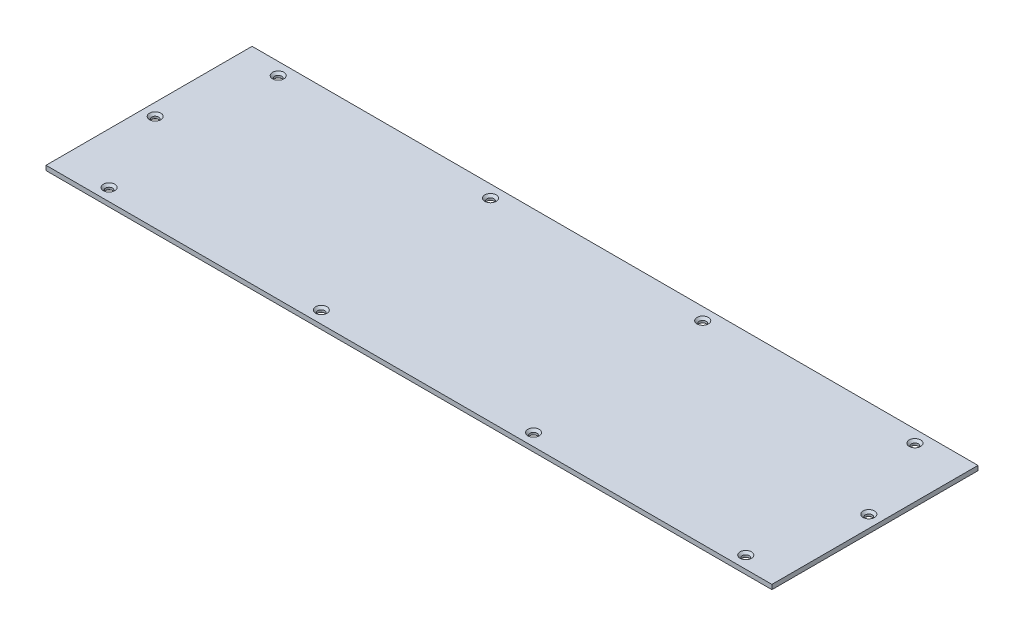
ISO-10303-21;
HEADER;
FILE_DESCRIPTION(('STEP AP214'),'2;1');
FILE_NAME('part.step','',(''),(''),'','','');
FILE_SCHEMA(('AUTOMOTIVE_DESIGN { 1 0 10303 214 1 1 1 1 }'));
ENDSEC;
DATA;
#1=APPLICATION_CONTEXT('core data for automotive mechanical design processes');
#2=APPLICATION_PROTOCOL_DEFINITION('international standard','automotive_design',2000,#1);
#3=PRODUCT_CONTEXT('',#1,'mechanical');
#4=PRODUCT('Part','Part','',(#3));
#5=PRODUCT_RELATED_PRODUCT_CATEGORY('part','',(#4));
#6=PRODUCT_DEFINITION_FORMATION('','',#4);
#7=PRODUCT_DEFINITION_CONTEXT('part definition',#1,'design');
#8=PRODUCT_DEFINITION('design','',#6,#7);
#9=PRODUCT_DEFINITION_SHAPE('','',#8);
#10=(LENGTH_UNIT() NAMED_UNIT(*) SI_UNIT(.MILLI.,.METRE.));
#11=(NAMED_UNIT(*) PLANE_ANGLE_UNIT() SI_UNIT($,.RADIAN.));
#12=(NAMED_UNIT(*) SI_UNIT($,.STERADIAN.) SOLID_ANGLE_UNIT());
#13=UNCERTAINTY_MEASURE_WITH_UNIT(LENGTH_MEASURE(1.E-05),#10,'distance_accuracy_value','');
#14=(GEOMETRIC_REPRESENTATION_CONTEXT(3) GLOBAL_UNCERTAINTY_ASSIGNED_CONTEXT((#13)) GLOBAL_UNIT_ASSIGNED_CONTEXT((#10,
#11,#12)) REPRESENTATION_CONTEXT('',''));
#15=CARTESIAN_POINT('',(0.,0.,0.));
#16=DIRECTION('',(0.,0.,1.));
#17=DIRECTION('',(1.,0.,0.));
#18=AXIS2_PLACEMENT_3D('',#15,#16,#17);
#19=CARTESIAN_POINT('',(0.,3.,0.));
#20=DIRECTION('',(1.,0.,0.));
#21=DIRECTION('',(0.,0.,-1.));
#22=AXIS2_PLACEMENT_3D('',#19,#20,#21);
#23=PLANE('',#22);
#24=DIRECTION('',(0.,0.,1.));
#25=VECTOR('',#24,1.);
#26=CARTESIAN_POINT('',(0.,0.,0.));
#27=LINE('',#26,#25);
#28=CARTESIAN_POINT('',(0.,0.,-134.));
#29=VERTEX_POINT('',#28);
#30=CARTESIAN_POINT('',(0.,0.,0.));
#31=VERTEX_POINT('',#30);
#32=EDGE_CURVE('E94',#29,#31,#27,.T.);
#33=ORIENTED_EDGE('',*,*,#32,.T.);
#34=DIRECTION('',(0.,-1.,0.));
#35=VECTOR('',#34,1.);
#36=CARTESIAN_POINT('',(0.,3.,0.));
#37=LINE('',#36,#35);
#38=CARTESIAN_POINT('',(0.,3.,0.));
#39=VERTEX_POINT('',#38);
#40=EDGE_CURVE('E11',#39,#31,#37,.T.);
#41=ORIENTED_EDGE('',*,*,#40,.F.);
#42=DIRECTION('',(0.,0.,1.));
#43=VECTOR('',#42,1.);
#44=CARTESIAN_POINT('',(0.,3.,0.));
#45=LINE('',#44,#43);
#46=CARTESIAN_POINT('',(0.,3.,-134.));
#47=VERTEX_POINT('',#46);
#48=EDGE_CURVE('E82',#47,#39,#45,.T.);
#49=ORIENTED_EDGE('',*,*,#48,.F.);
#50=DIRECTION('',(0.,-1.,0.));
#51=VECTOR('',#50,1.);
#52=CARTESIAN_POINT('',(0.,3.,-134.));
#53=LINE('',#52,#51);
#54=EDGE_CURVE('E90',#47,#29,#53,.T.);
#55=ORIENTED_EDGE('',*,*,#54,.T.);
#56=EDGE_LOOP('',(#33,#41,#49,#55));
#57=FACE_BOUND('',#56,.T.);
#58=ADVANCED_FACE('F31',(#57),#23,.F.);
#59=CARTESIAN_POINT('',(0.,3.,0.));
#60=DIRECTION('',(0.,0.,-1.));
#61=DIRECTION('',(-1.,0.,0.));
#62=AXIS2_PLACEMENT_3D('',#59,#60,#61);
#63=PLANE('',#62);
#64=DIRECTION('',(1.,0.,0.));
#65=VECTOR('',#64,1.);
#66=CARTESIAN_POINT('',(0.,0.,0.));
#67=LINE('',#66,#65);
#68=CARTESIAN_POINT('',(472.,0.,0.));
#69=VERTEX_POINT('',#68);
#70=EDGE_CURVE('E86',#31,#69,#67,.T.);
#71=ORIENTED_EDGE('',*,*,#70,.T.);
#72=DIRECTION('',(0.,-1.,0.));
#73=VECTOR('',#72,1.);
#74=CARTESIAN_POINT('',(472.,3.,0.));
#75=LINE('',#74,#73);
#76=CARTESIAN_POINT('',(472.,3.,0.));
#77=VERTEX_POINT('',#76);
#78=EDGE_CURVE('E39',#77,#69,#75,.T.);
#79=ORIENTED_EDGE('',*,*,#78,.F.);
#80=DIRECTION('',(1.,0.,0.));
#81=VECTOR('',#80,1.);
#82=CARTESIAN_POINT('',(0.,3.,0.));
#83=LINE('',#82,#81);
#84=EDGE_CURVE('E77',#39,#77,#83,.T.);
#85=ORIENTED_EDGE('',*,*,#84,.F.);
#86=ORIENTED_EDGE('',*,*,#40,.T.);
#87=EDGE_LOOP('',(#71,#79,#85,#86));
#88=FACE_BOUND('',#87,.T.);
#89=ADVANCED_FACE('F85',(#88),#63,.F.);
#90=CARTESIAN_POINT('',(472.,3.,0.));
#91=DIRECTION('',(-1.,0.,0.));
#92=DIRECTION('',(0.,0.,1.));
#93=AXIS2_PLACEMENT_3D('',#90,#91,#92);
#94=PLANE('',#93);
#95=DIRECTION('',(0.,0.,-1.));
#96=VECTOR('',#95,1.);
#97=CARTESIAN_POINT('',(472.,0.,0.));
#98=LINE('',#97,#96);
#99=CARTESIAN_POINT('',(472.,0.,-134.));
#100=VERTEX_POINT('',#99);
#101=EDGE_CURVE('E64',#69,#100,#98,.T.);
#102=ORIENTED_EDGE('',*,*,#101,.T.);
#103=DIRECTION('',(0.,-1.,0.));
#104=VECTOR('',#103,1.);
#105=CARTESIAN_POINT('',(472.,3.,-134.));
#106=LINE('',#105,#104);
#107=CARTESIAN_POINT('',(472.,3.,-134.));
#108=VERTEX_POINT('',#107);
#109=EDGE_CURVE('E87',#108,#100,#106,.T.);
#110=ORIENTED_EDGE('',*,*,#109,.F.);
#111=DIRECTION('',(0.,0.,-1.));
#112=VECTOR('',#111,1.);
#113=CARTESIAN_POINT('',(472.,3.,0.));
#114=LINE('',#113,#112);
#115=EDGE_CURVE('E80',#77,#108,#114,.T.);
#116=ORIENTED_EDGE('',*,*,#115,.F.);
#117=ORIENTED_EDGE('',*,*,#78,.T.);
#118=EDGE_LOOP('',(#102,#110,#116,#117));
#119=FACE_BOUND('',#118,.T.);
#120=ADVANCED_FACE('F88',(#119),#94,.F.);
#121=CARTESIAN_POINT('',(0.,3.,-134.));
#122=DIRECTION('',(0.,0.,1.));
#123=DIRECTION('',(1.,0.,0.));
#124=AXIS2_PLACEMENT_3D('',#121,#122,#123);
#125=PLANE('',#124);
#126=DIRECTION('',(-1.,0.,0.));
#127=VECTOR('',#126,1.);
#128=CARTESIAN_POINT('',(0.,0.,-134.));
#129=LINE('',#128,#127);
#130=EDGE_CURVE('E70',#100,#29,#129,.T.);
#131=ORIENTED_EDGE('',*,*,#130,.T.);
#132=ORIENTED_EDGE('',*,*,#54,.F.);
#133=DIRECTION('',(-1.,0.,0.));
#134=VECTOR('',#133,1.);
#135=CARTESIAN_POINT('',(0.,3.,-134.));
#136=LINE('',#135,#134);
#137=EDGE_CURVE('E47',#108,#47,#136,.T.);
#138=ORIENTED_EDGE('',*,*,#137,.F.);
#139=ORIENTED_EDGE('',*,*,#109,.T.);
#140=EDGE_LOOP('',(#131,#132,#138,#139));
#141=FACE_BOUND('',#140,.T.);
#142=ADVANCED_FACE('F102',(#141),#125,.F.);
#143=CARTESIAN_POINT('',(0.,3.,-134.));
#144=DIRECTION('',(0.,-1.,0.));
#145=DIRECTION('',(0.,0.,-1.));
#146=AXIS2_PLACEMENT_3D('',#143,#144,#145);
#147=PLANE('',#146);
#148=CARTESIAN_POINT('',(25.0000000000003,3.,-126.));
#149=DIRECTION('',(0.,1.,0.));
#150=DIRECTION('',(0.,0.,1.));
#151=AXIS2_PLACEMENT_3D('',#148,#149,#150);
#152=CIRCLE('',#151,3.7);
#153=CARTESIAN_POINT('',(25.0000000000003,3.,-122.3));
#154=VERTEX_POINT('',#153);
#155=EDGE_CURVE('E221',#154,#154,#152,.T.);
#156=ORIENTED_EDGE('',*,*,#155,.F.);
#157=EDGE_LOOP('',(#156));
#158=FACE_BOUND('',#157,.T.);
#159=CARTESIAN_POINT('',(163.,3.,-126.));
#160=DIRECTION('',(0.,1.,0.));
#161=DIRECTION('',(0.,0.,1.));
#162=AXIS2_PLACEMENT_3D('',#159,#160,#161);
#163=CIRCLE('',#162,3.70000000000001);
#164=CARTESIAN_POINT('',(163.,3.,-122.3));
#165=VERTEX_POINT('',#164);
#166=EDGE_CURVE('E209',#165,#165,#163,.T.);
#167=ORIENTED_EDGE('',*,*,#166,.F.);
#168=EDGE_LOOP('',(#167));
#169=FACE_BOUND('',#168,.T.);
#170=CARTESIAN_POINT('',(301.,3.,-126.));
#171=DIRECTION('',(0.,1.,0.));
#172=DIRECTION('',(0.,0.,1.));
#173=AXIS2_PLACEMENT_3D('',#170,#171,#172);
#174=CIRCLE('',#173,3.69999999999998);
#175=CARTESIAN_POINT('',(301.,3.,-122.3));
#176=VERTEX_POINT('',#175);
#177=EDGE_CURVE('E197',#176,#176,#174,.T.);
#178=ORIENTED_EDGE('',*,*,#177,.F.);
#179=EDGE_LOOP('',(#178));
#180=FACE_BOUND('',#179,.T.);
#181=CARTESIAN_POINT('',(439.,3.,-126.));
#182=DIRECTION('',(0.,1.,0.));
#183=DIRECTION('',(0.,0.,1.));
#184=AXIS2_PLACEMENT_3D('',#181,#182,#183);
#185=CIRCLE('',#184,3.69999999999998);
#186=CARTESIAN_POINT('',(439.,3.,-122.3));
#187=VERTEX_POINT('',#186);
#188=EDGE_CURVE('E185',#187,#187,#185,.T.);
#189=ORIENTED_EDGE('',*,*,#188,.F.);
#190=EDGE_LOOP('',(#189));
#191=FACE_BOUND('',#190,.T.);
#192=CARTESIAN_POINT('',(464.,3.,-71.));
#193=DIRECTION('',(0.,1.,0.));
#194=DIRECTION('',(0.,0.,1.));
#195=AXIS2_PLACEMENT_3D('',#192,#193,#194);
#196=CIRCLE('',#195,3.69999999999998);
#197=CARTESIAN_POINT('',(464.,3.,-67.3));
#198=VERTEX_POINT('',#197);
#199=EDGE_CURVE('E173',#198,#198,#196,.T.);
#200=ORIENTED_EDGE('',*,*,#199,.F.);
#201=EDGE_LOOP('',(#200));
#202=FACE_BOUND('',#201,.T.);
#203=CARTESIAN_POINT('',(447.,3.,-8.00000000000004));
#204=DIRECTION('',(0.,1.,0.));
#205=DIRECTION('',(0.,0.,1.));
#206=AXIS2_PLACEMENT_3D('',#203,#204,#205);
#207=CIRCLE('',#206,3.69999999999998);
#208=CARTESIAN_POINT('',(447.,3.,-4.30000000000006));
#209=VERTEX_POINT('',#208);
#210=EDGE_CURVE('E161',#209,#209,#207,.T.);
#211=ORIENTED_EDGE('',*,*,#210,.F.);
#212=EDGE_LOOP('',(#211));
#213=FACE_BOUND('',#212,.T.);
#214=CARTESIAN_POINT('',(309.,3.,-8.00000000000004));
#215=DIRECTION('',(0.,1.,0.));
#216=DIRECTION('',(0.,0.,1.));
#217=AXIS2_PLACEMENT_3D('',#214,#215,#216);
#218=CIRCLE('',#217,3.69999999999998);
#219=CARTESIAN_POINT('',(309.,3.,-4.30000000000006));
#220=VERTEX_POINT('',#219);
#221=EDGE_CURVE('E149',#220,#220,#218,.T.);
#222=ORIENTED_EDGE('',*,*,#221,.F.);
#223=EDGE_LOOP('',(#222));
#224=FACE_BOUND('',#223,.T.);
#225=CARTESIAN_POINT('',(171.,3.,-8.00000000000004));
#226=DIRECTION('',(0.,1.,0.));
#227=DIRECTION('',(0.,0.,1.));
#228=AXIS2_PLACEMENT_3D('',#225,#226,#227);
#229=CIRCLE('',#228,3.70000000000001);
#230=CARTESIAN_POINT('',(171.,3.,-4.30000000000003));
#231=VERTEX_POINT('',#230);
#232=EDGE_CURVE('E137',#231,#231,#229,.T.);
#233=ORIENTED_EDGE('',*,*,#232,.F.);
#234=EDGE_LOOP('',(#233));
#235=FACE_BOUND('',#234,.T.);
#236=CARTESIAN_POINT('',(33.0000000000001,3.,-8.00000000000004));
#237=DIRECTION('',(0.,1.,0.));
#238=DIRECTION('',(0.,0.,1.));
#239=AXIS2_PLACEMENT_3D('',#236,#237,#238);
#240=CIRCLE('',#239,3.7);
#241=CARTESIAN_POINT('',(33.0000000000001,3.,-4.30000000000004));
#242=VERTEX_POINT('',#241);
#243=EDGE_CURVE('E125',#242,#242,#240,.T.);
#244=ORIENTED_EDGE('',*,*,#243,.F.);
#245=EDGE_LOOP('',(#244));
#246=FACE_BOUND('',#245,.T.);
#247=CARTESIAN_POINT('',(8.,3.,-63.));
#248=DIRECTION('',(0.,1.,0.));
#249=DIRECTION('',(0.,0.,1.));
#250=AXIS2_PLACEMENT_3D('',#247,#248,#249);
#251=CIRCLE('',#250,3.7);
#252=CARTESIAN_POINT('',(8.,3.,-59.3));
#253=VERTEX_POINT('',#252);
#254=EDGE_CURVE('E113',#253,#253,#251,.T.);
#255=ORIENTED_EDGE('',*,*,#254,.F.);
#256=EDGE_LOOP('',(#255));
#257=FACE_BOUND('',#256,.T.);
#258=ORIENTED_EDGE('',*,*,#48,.T.);
#259=ORIENTED_EDGE('',*,*,#84,.T.);
#260=ORIENTED_EDGE('',*,*,#115,.T.);
#261=ORIENTED_EDGE('',*,*,#137,.T.);
#262=EDGE_LOOP('',(#258,#259,#260,#261));
#263=FACE_BOUND('',#262,.T.);
#264=ADVANCED_FACE('F78',(#158,#169,#180,#191,#202,#213,#224,#235,#246,#257,#263),#147,.F.);
#265=CARTESIAN_POINT('',(0.,0.,-134.));
#266=DIRECTION('',(0.,-1.,0.));
#267=DIRECTION('',(0.,0.,-1.));
#268=AXIS2_PLACEMENT_3D('',#265,#266,#267);
#269=PLANE('',#268);
#270=CARTESIAN_POINT('',(25.0000000000003,0.,-126.));
#271=DIRECTION('',(0.,1.,0.));
#272=DIRECTION('',(0.,0.,1.));
#273=AXIS2_PLACEMENT_3D('',#270,#271,#272);
#274=CIRCLE('',#273,2.4);
#275=CARTESIAN_POINT('',(25.0000000000003,0.,-123.6));
#276=VERTEX_POINT('',#275);
#277=EDGE_CURVE('E224',#276,#276,#274,.T.);
#278=ORIENTED_EDGE('',*,*,#277,.T.);
#279=EDGE_LOOP('',(#278));
#280=FACE_BOUND('',#279,.T.);
#281=CARTESIAN_POINT('',(163.,0.,-126.));
#282=DIRECTION('',(0.,1.,0.));
#283=DIRECTION('',(0.,0.,1.));
#284=AXIS2_PLACEMENT_3D('',#281,#282,#283);
#285=CIRCLE('',#284,2.39999999999999);
#286=CARTESIAN_POINT('',(163.,0.,-123.6));
#287=VERTEX_POINT('',#286);
#288=EDGE_CURVE('E212',#287,#287,#285,.T.);
#289=ORIENTED_EDGE('',*,*,#288,.T.);
#290=EDGE_LOOP('',(#289));
#291=FACE_BOUND('',#290,.T.);
#292=CARTESIAN_POINT('',(301.,0.,-126.));
#293=DIRECTION('',(0.,1.,0.));
#294=DIRECTION('',(0.,0.,1.));
#295=AXIS2_PLACEMENT_3D('',#292,#293,#294);
#296=CIRCLE('',#295,2.40000000000001);
#297=CARTESIAN_POINT('',(301.,0.,-123.6));
#298=VERTEX_POINT('',#297);
#299=EDGE_CURVE('E200',#298,#298,#296,.T.);
#300=ORIENTED_EDGE('',*,*,#299,.T.);
#301=EDGE_LOOP('',(#300));
#302=FACE_BOUND('',#301,.T.);
#303=CARTESIAN_POINT('',(439.,0.,-126.));
#304=DIRECTION('',(0.,1.,0.));
#305=DIRECTION('',(0.,0.,1.));
#306=AXIS2_PLACEMENT_3D('',#303,#304,#305);
#307=CIRCLE('',#306,2.40000000000001);
#308=CARTESIAN_POINT('',(439.,0.,-123.6));
#309=VERTEX_POINT('',#308);
#310=EDGE_CURVE('E188',#309,#309,#307,.T.);
#311=ORIENTED_EDGE('',*,*,#310,.T.);
#312=EDGE_LOOP('',(#311));
#313=FACE_BOUND('',#312,.T.);
#314=CARTESIAN_POINT('',(464.,0.,-71.));
#315=DIRECTION('',(0.,1.,0.));
#316=DIRECTION('',(0.,0.,1.));
#317=AXIS2_PLACEMENT_3D('',#314,#315,#316);
#318=CIRCLE('',#317,2.40000000000001);
#319=CARTESIAN_POINT('',(464.,0.,-68.6));
#320=VERTEX_POINT('',#319);
#321=EDGE_CURVE('E176',#320,#320,#318,.T.);
#322=ORIENTED_EDGE('',*,*,#321,.T.);
#323=EDGE_LOOP('',(#322));
#324=FACE_BOUND('',#323,.T.);
#325=CARTESIAN_POINT('',(447.,0.,-8.00000000000004));
#326=DIRECTION('',(0.,1.,0.));
#327=DIRECTION('',(0.,0.,1.));
#328=AXIS2_PLACEMENT_3D('',#325,#326,#327);
#329=CIRCLE('',#328,2.40000000000001);
#330=CARTESIAN_POINT('',(447.,0.,-5.60000000000003));
#331=VERTEX_POINT('',#330);
#332=EDGE_CURVE('E164',#331,#331,#329,.T.);
#333=ORIENTED_EDGE('',*,*,#332,.T.);
#334=EDGE_LOOP('',(#333));
#335=FACE_BOUND('',#334,.T.);
#336=CARTESIAN_POINT('',(309.,0.,-8.00000000000004));
#337=DIRECTION('',(0.,1.,0.));
#338=DIRECTION('',(0.,0.,1.));
#339=AXIS2_PLACEMENT_3D('',#336,#337,#338);
#340=CIRCLE('',#339,2.40000000000001);
#341=CARTESIAN_POINT('',(309.,0.,-5.60000000000003));
#342=VERTEX_POINT('',#341);
#343=EDGE_CURVE('E152',#342,#342,#340,.T.);
#344=ORIENTED_EDGE('',*,*,#343,.T.);
#345=EDGE_LOOP('',(#344));
#346=FACE_BOUND('',#345,.T.);
#347=CARTESIAN_POINT('',(171.,0.,-8.00000000000004));
#348=DIRECTION('',(0.,1.,0.));
#349=DIRECTION('',(0.,0.,1.));
#350=AXIS2_PLACEMENT_3D('',#347,#348,#349);
#351=CIRCLE('',#350,2.40000000000001);
#352=CARTESIAN_POINT('',(171.,0.,-5.60000000000003));
#353=VERTEX_POINT('',#352);
#354=EDGE_CURVE('E140',#353,#353,#351,.T.);
#355=ORIENTED_EDGE('',*,*,#354,.T.);
#356=EDGE_LOOP('',(#355));
#357=FACE_BOUND('',#356,.T.);
#358=CARTESIAN_POINT('',(33.0000000000001,0.,-8.00000000000004));
#359=DIRECTION('',(0.,1.,0.));
#360=DIRECTION('',(0.,0.,1.));
#361=AXIS2_PLACEMENT_3D('',#358,#359,#360);
#362=CIRCLE('',#361,2.4);
#363=CARTESIAN_POINT('',(33.0000000000001,0.,-5.60000000000004));
#364=VERTEX_POINT('',#363);
#365=EDGE_CURVE('E128',#364,#364,#362,.T.);
#366=ORIENTED_EDGE('',*,*,#365,.T.);
#367=EDGE_LOOP('',(#366));
#368=FACE_BOUND('',#367,.T.);
#369=CARTESIAN_POINT('',(8.,0.,-63.));
#370=DIRECTION('',(0.,1.,0.));
#371=DIRECTION('',(0.,0.,1.));
#372=AXIS2_PLACEMENT_3D('',#369,#370,#371);
#373=CIRCLE('',#372,2.4);
#374=CARTESIAN_POINT('',(8.,0.,-60.6));
#375=VERTEX_POINT('',#374);
#376=EDGE_CURVE('E116',#375,#375,#373,.T.);
#377=ORIENTED_EDGE('',*,*,#376,.T.);
#378=EDGE_LOOP('',(#377));
#379=FACE_BOUND('',#378,.T.);
#380=ORIENTED_EDGE('',*,*,#32,.F.);
#381=ORIENTED_EDGE('',*,*,#130,.F.);
#382=ORIENTED_EDGE('',*,*,#101,.F.);
#383=ORIENTED_EDGE('',*,*,#70,.F.);
#384=EDGE_LOOP('',(#380,#381,#382,#383));
#385=FACE_BOUND('',#384,.T.);
#386=ADVANCED_FACE('F105',(#280,#291,#302,#313,#324,#335,#346,#357,#368,#379,#385),#269,.T.);
#387=CARTESIAN_POINT('',(8.,0.150000000000001,-63.));
#388=DIRECTION('',(0.,-1.,0.));
#389=DIRECTION('',(0.,0.,-1.));
#390=AXIS2_PLACEMENT_3D('',#387,#388,#389);
#391=CONICAL_SURFACE('',#390,2.25,0.785398163397441);
#392=ORIENTED_EDGE('',*,*,#376,.F.);
#393=EDGE_LOOP('',(#392));
#394=FACE_BOUND('',#393,.T.);
#395=CARTESIAN_POINT('',(8.,0.150000000000001,-63.));
#396=DIRECTION('',(0.,1.,0.));
#397=DIRECTION('',(0.,0.,1.));
#398=AXIS2_PLACEMENT_3D('',#395,#396,#397);
#399=CIRCLE('',#398,2.25);
#400=CARTESIAN_POINT('',(8.,0.150000000000001,-60.75));
#401=VERTEX_POINT('',#400);
#402=EDGE_CURVE('E97',#401,#401,#399,.T.);
#403=ORIENTED_EDGE('',*,*,#402,.T.);
#404=EDGE_LOOP('',(#403));
#405=FACE_BOUND('',#404,.T.);
#406=ADVANCED_FACE('F283',(#394,#405),#391,.F.);
#407=CARTESIAN_POINT('',(8.,3.,-63.));
#408=DIRECTION('',(0.,1.,0.));
#409=DIRECTION('',(0.,0.,1.));
#410=AXIS2_PLACEMENT_3D('',#407,#408,#409);
#411=CYLINDRICAL_SURFACE('',#410,2.25);
#412=ORIENTED_EDGE('',*,*,#402,.F.);
#413=EDGE_LOOP('',(#412));
#414=FACE_BOUND('',#413,.T.);
#415=CARTESIAN_POINT('',(8.,1.55,-63.));
#416=DIRECTION('',(0.,1.,0.));
#417=DIRECTION('',(0.,0.,1.));
#418=AXIS2_PLACEMENT_3D('',#415,#416,#417);
#419=CIRCLE('',#418,2.25);
#420=CARTESIAN_POINT('',(8.,1.55,-60.75));
#421=VERTEX_POINT('',#420);
#422=EDGE_CURVE('E110',#421,#421,#419,.T.);
#423=ORIENTED_EDGE('',*,*,#422,.T.);
#424=EDGE_LOOP('',(#423));
#425=FACE_BOUND('',#424,.T.);
#426=ADVANCED_FACE('F273',(#414,#425),#411,.F.);
#427=CARTESIAN_POINT('',(8.,3.,-63.));
#428=DIRECTION('',(0.,1.,0.));
#429=DIRECTION('',(0.,0.,1.));
#430=AXIS2_PLACEMENT_3D('',#427,#428,#429);
#431=CONICAL_SURFACE('',#430,3.7,0.785398163397447);
#432=ORIENTED_EDGE('',*,*,#422,.F.);
#433=EDGE_LOOP('',(#432));
#434=FACE_BOUND('',#433,.T.);
#435=ORIENTED_EDGE('',*,*,#254,.T.);
#436=EDGE_LOOP('',(#435));
#437=FACE_BOUND('',#436,.T.);
#438=ADVANCED_FACE('F270',(#434,#437),#431,.F.);
#439=CARTESIAN_POINT('',(33.0000000000001,0.150000000000001,-8.00000000000004));
#440=DIRECTION('',(0.,-1.,0.));
#441=DIRECTION('',(0.,0.,-1.));
#442=AXIS2_PLACEMENT_3D('',#439,#440,#441);
#443=CONICAL_SURFACE('',#442,2.25,0.785398163397435);
#444=ORIENTED_EDGE('',*,*,#365,.F.);
#445=EDGE_LOOP('',(#444));
#446=FACE_BOUND('',#445,.T.);
#447=CARTESIAN_POINT('',(33.0000000000001,0.150000000000001,-8.00000000000004));
#448=DIRECTION('',(0.,1.,0.));
#449=DIRECTION('',(0.,0.,1.));
#450=AXIS2_PLACEMENT_3D('',#447,#448,#449);
#451=CIRCLE('',#450,2.25);
#452=CARTESIAN_POINT('',(33.0000000000001,0.150000000000001,-5.75000000000004));
#453=VERTEX_POINT('',#452);
#454=EDGE_CURVE('E119',#453,#453,#451,.T.);
#455=ORIENTED_EDGE('',*,*,#454,.T.);
#456=EDGE_LOOP('',(#455));
#457=FACE_BOUND('',#456,.T.);
#458=ADVANCED_FACE('F272',(#446,#457),#443,.F.);
#459=CARTESIAN_POINT('',(33.0000000000001,3.,-8.00000000000004));
#460=DIRECTION('',(0.,1.,0.));
#461=DIRECTION('',(0.,0.,1.));
#462=AXIS2_PLACEMENT_3D('',#459,#460,#461);
#463=CYLINDRICAL_SURFACE('',#462,2.25);
#464=ORIENTED_EDGE('',*,*,#454,.F.);
#465=EDGE_LOOP('',(#464));
#466=FACE_BOUND('',#465,.T.);
#467=CARTESIAN_POINT('',(33.0000000000001,1.55,-8.00000000000004));
#468=DIRECTION('',(0.,1.,0.));
#469=DIRECTION('',(0.,0.,1.));
#470=AXIS2_PLACEMENT_3D('',#467,#468,#469);
#471=CIRCLE('',#470,2.25);
#472=CARTESIAN_POINT('',(33.0000000000001,1.55,-5.75000000000004));
#473=VERTEX_POINT('',#472);
#474=EDGE_CURVE('E122',#473,#473,#471,.T.);
#475=ORIENTED_EDGE('',*,*,#474,.T.);
#476=EDGE_LOOP('',(#475));
#477=FACE_BOUND('',#476,.T.);
#478=ADVANCED_FACE('F280',(#466,#477),#463,.F.);
#479=CARTESIAN_POINT('',(33.0000000000001,3.,-8.00000000000004));
#480=DIRECTION('',(0.,1.,0.));
#481=DIRECTION('',(0.,0.,1.));
#482=AXIS2_PLACEMENT_3D('',#479,#480,#481);
#483=CONICAL_SURFACE('',#482,3.7,0.785398163397447);
#484=ORIENTED_EDGE('',*,*,#474,.F.);
#485=EDGE_LOOP('',(#484));
#486=FACE_BOUND('',#485,.T.);
#487=ORIENTED_EDGE('',*,*,#243,.T.);
#488=EDGE_LOOP('',(#487));
#489=FACE_BOUND('',#488,.T.);
#490=ADVANCED_FACE('F336',(#486,#489),#483,.F.);
#491=CARTESIAN_POINT('',(171.,0.150000000000001,-8.00000000000004));
#492=DIRECTION('',(0.,-1.,0.));
#493=DIRECTION('',(0.,0.,-1.));
#494=AXIS2_PLACEMENT_3D('',#491,#492,#493);
#495=CONICAL_SURFACE('',#494,2.25,0.785398163397482);
#496=ORIENTED_EDGE('',*,*,#354,.F.);
#497=EDGE_LOOP('',(#496));
#498=FACE_BOUND('',#497,.T.);
#499=CARTESIAN_POINT('',(171.,0.150000000000001,-8.00000000000004));
#500=DIRECTION('',(0.,1.,0.));
#501=DIRECTION('',(0.,0.,1.));
#502=AXIS2_PLACEMENT_3D('',#499,#500,#501);
#503=CIRCLE('',#502,2.25);
#504=CARTESIAN_POINT('',(171.,0.150000000000001,-5.75000000000004));
#505=VERTEX_POINT('',#504);
#506=EDGE_CURVE('E131',#505,#505,#503,.T.);
#507=ORIENTED_EDGE('',*,*,#506,.T.);
#508=EDGE_LOOP('',(#507));
#509=FACE_BOUND('',#508,.T.);
#510=ADVANCED_FACE('F346',(#498,#509),#495,.F.);
#511=CARTESIAN_POINT('',(171.,3.,-8.00000000000004));
#512=DIRECTION('',(0.,1.,0.));
#513=DIRECTION('',(0.,0.,1.));
#514=AXIS2_PLACEMENT_3D('',#511,#512,#513);
#515=CYLINDRICAL_SURFACE('',#514,2.25);
#516=ORIENTED_EDGE('',*,*,#506,.F.);
#517=EDGE_LOOP('',(#516));
#518=FACE_BOUND('',#517,.T.);
#519=CARTESIAN_POINT('',(171.,1.55,-8.00000000000004));
#520=DIRECTION('',(0.,1.,0.));
#521=DIRECTION('',(0.,0.,1.));
#522=AXIS2_PLACEMENT_3D('',#519,#520,#521);
#523=CIRCLE('',#522,2.25);
#524=CARTESIAN_POINT('',(171.,1.55,-5.75000000000004));
#525=VERTEX_POINT('',#524);
#526=EDGE_CURVE('E134',#525,#525,#523,.T.);
#527=ORIENTED_EDGE('',*,*,#526,.T.);
#528=EDGE_LOOP('',(#527));
#529=FACE_BOUND('',#528,.T.);
#530=ADVANCED_FACE('F356',(#518,#529),#515,.F.);
#531=CARTESIAN_POINT('',(171.,3.,-8.00000000000004));
#532=DIRECTION('',(0.,1.,0.));
#533=DIRECTION('',(0.,0.,1.));
#534=AXIS2_PLACEMENT_3D('',#531,#532,#533);
#535=CONICAL_SURFACE('',#534,3.70000000000001,0.78539816339745);
#536=ORIENTED_EDGE('',*,*,#526,.F.);
#537=EDGE_LOOP('',(#536));
#538=FACE_BOUND('',#537,.T.);
#539=ORIENTED_EDGE('',*,*,#232,.T.);
#540=EDGE_LOOP('',(#539));
#541=FACE_BOUND('',#540,.T.);
#542=ADVANCED_FACE('F366',(#538,#541),#535,.F.);
#543=CARTESIAN_POINT('',(309.,0.150000000000001,-8.00000000000004));
#544=DIRECTION('',(0.,-1.,0.));
#545=DIRECTION('',(0.,0.,-1.));
#546=AXIS2_PLACEMENT_3D('',#543,#544,#545);
#547=CONICAL_SURFACE('',#546,2.24999999999997,0.785398163397574);
#548=ORIENTED_EDGE('',*,*,#343,.F.);
#549=EDGE_LOOP('',(#548));
#550=FACE_BOUND('',#549,.T.);
#551=CARTESIAN_POINT('',(309.,0.150000000000001,-8.00000000000004));
#552=DIRECTION('',(0.,1.,0.));
#553=DIRECTION('',(0.,0.,1.));
#554=AXIS2_PLACEMENT_3D('',#551,#552,#553);
#555=CIRCLE('',#554,2.24999999999997);
#556=CARTESIAN_POINT('',(309.,0.150000000000001,-5.75000000000007));
#557=VERTEX_POINT('',#556);
#558=EDGE_CURVE('E143',#557,#557,#555,.T.);
#559=ORIENTED_EDGE('',*,*,#558,.T.);
#560=EDGE_LOOP('',(#559));
#561=FACE_BOUND('',#560,.T.);
#562=ADVANCED_FACE('F376',(#550,#561),#547,.F.);
#563=CARTESIAN_POINT('',(309.,3.,-8.00000000000004));
#564=DIRECTION('',(0.,1.,0.));
#565=DIRECTION('',(0.,0.,1.));
#566=AXIS2_PLACEMENT_3D('',#563,#564,#565);
#567=CYLINDRICAL_SURFACE('',#566,2.24999999999997);
#568=ORIENTED_EDGE('',*,*,#558,.F.);
#569=EDGE_LOOP('',(#568));
#570=FACE_BOUND('',#569,.T.);
#571=CARTESIAN_POINT('',(309.,1.55,-8.00000000000004));
#572=DIRECTION('',(0.,1.,0.));
#573=DIRECTION('',(0.,0.,1.));
#574=AXIS2_PLACEMENT_3D('',#571,#572,#573);
#575=CIRCLE('',#574,2.24999999999997);
#576=CARTESIAN_POINT('',(309.,1.55,-5.75000000000007));
#577=VERTEX_POINT('',#576);
#578=EDGE_CURVE('E146',#577,#577,#575,.T.);
#579=ORIENTED_EDGE('',*,*,#578,.T.);
#580=EDGE_LOOP('',(#579));
#581=FACE_BOUND('',#580,.T.);
#582=ADVANCED_FACE('F386',(#570,#581),#567,.F.);
#583=CARTESIAN_POINT('',(309.,3.,-8.00000000000004));
#584=DIRECTION('',(0.,1.,0.));
#585=DIRECTION('',(0.,0.,1.));
#586=AXIS2_PLACEMENT_3D('',#583,#584,#585);
#587=CONICAL_SURFACE('',#586,3.69999999999998,0.78539816339745);
#588=ORIENTED_EDGE('',*,*,#578,.F.);
#589=EDGE_LOOP('',(#588));
#590=FACE_BOUND('',#589,.T.);
#591=ORIENTED_EDGE('',*,*,#221,.T.);
#592=EDGE_LOOP('',(#591));
#593=FACE_BOUND('',#592,.T.);
#594=ADVANCED_FACE('F396',(#590,#593),#587,.F.);
#595=CARTESIAN_POINT('',(447.,0.150000000000001,-8.00000000000004));
#596=DIRECTION('',(0.,-1.,0.));
#597=DIRECTION('',(0.,0.,-1.));
#598=AXIS2_PLACEMENT_3D('',#595,#596,#597);
#599=CONICAL_SURFACE('',#598,2.24999999999997,0.785398163397574);
#600=ORIENTED_EDGE('',*,*,#332,.F.);
#601=EDGE_LOOP('',(#600));
#602=FACE_BOUND('',#601,.T.);
#603=CARTESIAN_POINT('',(447.,0.150000000000001,-8.00000000000004));
#604=DIRECTION('',(0.,1.,0.));
#605=DIRECTION('',(0.,0.,1.));
#606=AXIS2_PLACEMENT_3D('',#603,#604,#605);
#607=CIRCLE('',#606,2.24999999999997);
#608=CARTESIAN_POINT('',(447.,0.150000000000001,-5.75000000000007));
#609=VERTEX_POINT('',#608);
#610=EDGE_CURVE('E155',#609,#609,#607,.T.);
#611=ORIENTED_EDGE('',*,*,#610,.T.);
#612=EDGE_LOOP('',(#611));
#613=FACE_BOUND('',#612,.T.);
#614=ADVANCED_FACE('F406',(#602,#613),#599,.F.);
#615=CARTESIAN_POINT('',(447.,3.,-8.00000000000004));
#616=DIRECTION('',(0.,1.,0.));
#617=DIRECTION('',(0.,0.,1.));
#618=AXIS2_PLACEMENT_3D('',#615,#616,#617);
#619=CYLINDRICAL_SURFACE('',#618,2.24999999999997);
#620=ORIENTED_EDGE('',*,*,#610,.F.);
#621=EDGE_LOOP('',(#620));
#622=FACE_BOUND('',#621,.T.);
#623=CARTESIAN_POINT('',(447.,1.55,-8.00000000000004));
#624=DIRECTION('',(0.,1.,0.));
#625=DIRECTION('',(0.,0.,1.));
#626=AXIS2_PLACEMENT_3D('',#623,#624,#625);
#627=CIRCLE('',#626,2.24999999999997);
#628=CARTESIAN_POINT('',(447.,1.55,-5.75000000000007));
#629=VERTEX_POINT('',#628);
#630=EDGE_CURVE('E158',#629,#629,#627,.T.);
#631=ORIENTED_EDGE('',*,*,#630,.T.);
#632=EDGE_LOOP('',(#631));
#633=FACE_BOUND('',#632,.T.);
#634=ADVANCED_FACE('F416',(#622,#633),#619,.F.);
#635=CARTESIAN_POINT('',(447.,3.,-8.00000000000004));
#636=DIRECTION('',(0.,1.,0.));
#637=DIRECTION('',(0.,0.,1.));
#638=AXIS2_PLACEMENT_3D('',#635,#636,#637);
#639=CONICAL_SURFACE('',#638,3.69999999999998,0.78539816339745);
#640=ORIENTED_EDGE('',*,*,#630,.F.);
#641=EDGE_LOOP('',(#640));
#642=FACE_BOUND('',#641,.T.);
#643=ORIENTED_EDGE('',*,*,#210,.T.);
#644=EDGE_LOOP('',(#643));
#645=FACE_BOUND('',#644,.T.);
#646=ADVANCED_FACE('F426',(#642,#645),#639,.F.);
#647=CARTESIAN_POINT('',(464.,0.150000000000001,-71.));
#648=DIRECTION('',(0.,-1.,0.));
#649=DIRECTION('',(0.,0.,-1.));
#650=AXIS2_PLACEMENT_3D('',#647,#648,#649);
#651=CONICAL_SURFACE('',#650,2.24999999999997,0.785398163397574);
#652=ORIENTED_EDGE('',*,*,#321,.F.);
#653=EDGE_LOOP('',(#652));
#654=FACE_BOUND('',#653,.T.);
#655=CARTESIAN_POINT('',(464.,0.150000000000001,-71.));
#656=DIRECTION('',(0.,1.,0.));
#657=DIRECTION('',(0.,0.,1.));
#658=AXIS2_PLACEMENT_3D('',#655,#656,#657);
#659=CIRCLE('',#658,2.24999999999997);
#660=CARTESIAN_POINT('',(464.,0.150000000000001,-68.75));
#661=VERTEX_POINT('',#660);
#662=EDGE_CURVE('E167',#661,#661,#659,.T.);
#663=ORIENTED_EDGE('',*,*,#662,.T.);
#664=EDGE_LOOP('',(#663));
#665=FACE_BOUND('',#664,.T.);
#666=ADVANCED_FACE('F436',(#654,#665),#651,.F.);
#667=CARTESIAN_POINT('',(464.,3.,-71.));
#668=DIRECTION('',(0.,1.,0.));
#669=DIRECTION('',(0.,0.,1.));
#670=AXIS2_PLACEMENT_3D('',#667,#668,#669);
#671=CYLINDRICAL_SURFACE('',#670,2.24999999999997);
#672=ORIENTED_EDGE('',*,*,#662,.F.);
#673=EDGE_LOOP('',(#672));
#674=FACE_BOUND('',#673,.T.);
#675=CARTESIAN_POINT('',(464.,1.55,-71.));
#676=DIRECTION('',(0.,1.,0.));
#677=DIRECTION('',(0.,0.,1.));
#678=AXIS2_PLACEMENT_3D('',#675,#676,#677);
#679=CIRCLE('',#678,2.24999999999997);
#680=CARTESIAN_POINT('',(464.,1.55,-68.75));
#681=VERTEX_POINT('',#680);
#682=EDGE_CURVE('E170',#681,#681,#679,.T.);
#683=ORIENTED_EDGE('',*,*,#682,.T.);
#684=EDGE_LOOP('',(#683));
#685=FACE_BOUND('',#684,.T.);
#686=ADVANCED_FACE('F446',(#674,#685),#671,.F.);
#687=CARTESIAN_POINT('',(464.,3.,-71.));
#688=DIRECTION('',(0.,1.,0.));
#689=DIRECTION('',(0.,0.,1.));
#690=AXIS2_PLACEMENT_3D('',#687,#688,#689);
#691=CONICAL_SURFACE('',#690,3.69999999999998,0.78539816339745);
#692=ORIENTED_EDGE('',*,*,#682,.F.);
#693=EDGE_LOOP('',(#692));
#694=FACE_BOUND('',#693,.T.);
#695=ORIENTED_EDGE('',*,*,#199,.T.);
#696=EDGE_LOOP('',(#695));
#697=FACE_BOUND('',#696,.T.);
#698=ADVANCED_FACE('F456',(#694,#697),#691,.F.);
#699=CARTESIAN_POINT('',(439.,0.150000000000001,-126.));
#700=DIRECTION('',(0.,-1.,0.));
#701=DIRECTION('',(0.,0.,-1.));
#702=AXIS2_PLACEMENT_3D('',#699,#700,#701);
#703=CONICAL_SURFACE('',#702,2.24999999999997,0.785398163397574);
#704=ORIENTED_EDGE('',*,*,#310,.F.);
#705=EDGE_LOOP('',(#704));
#706=FACE_BOUND('',#705,.T.);
#707=CARTESIAN_POINT('',(439.,0.150000000000001,-126.));
#708=DIRECTION('',(0.,1.,0.));
#709=DIRECTION('',(0.,0.,1.));
#710=AXIS2_PLACEMENT_3D('',#707,#708,#709);
#711=CIRCLE('',#710,2.24999999999997);
#712=CARTESIAN_POINT('',(439.,0.150000000000001,-123.75));
#713=VERTEX_POINT('',#712);
#714=EDGE_CURVE('E179',#713,#713,#711,.T.);
#715=ORIENTED_EDGE('',*,*,#714,.T.);
#716=EDGE_LOOP('',(#715));
#717=FACE_BOUND('',#716,.T.);
#718=ADVANCED_FACE('F466',(#706,#717),#703,.F.);
#719=CARTESIAN_POINT('',(439.,3.,-126.));
#720=DIRECTION('',(0.,1.,0.));
#721=DIRECTION('',(0.,0.,1.));
#722=AXIS2_PLACEMENT_3D('',#719,#720,#721);
#723=CYLINDRICAL_SURFACE('',#722,2.24999999999997);
#724=ORIENTED_EDGE('',*,*,#714,.F.);
#725=EDGE_LOOP('',(#724));
#726=FACE_BOUND('',#725,.T.);
#727=CARTESIAN_POINT('',(439.,1.55,-126.));
#728=DIRECTION('',(0.,1.,0.));
#729=DIRECTION('',(0.,0.,1.));
#730=AXIS2_PLACEMENT_3D('',#727,#728,#729);
#731=CIRCLE('',#730,2.24999999999997);
#732=CARTESIAN_POINT('',(439.,1.55,-123.75));
#733=VERTEX_POINT('',#732);
#734=EDGE_CURVE('E182',#733,#733,#731,.T.);
#735=ORIENTED_EDGE('',*,*,#734,.T.);
#736=EDGE_LOOP('',(#735));
#737=FACE_BOUND('',#736,.T.);
#738=ADVANCED_FACE('F476',(#726,#737),#723,.F.);
#739=CARTESIAN_POINT('',(439.,3.,-126.));
#740=DIRECTION('',(0.,1.,0.));
#741=DIRECTION('',(0.,0.,1.));
#742=AXIS2_PLACEMENT_3D('',#739,#740,#741);
#743=CONICAL_SURFACE('',#742,3.69999999999998,0.78539816339745);
#744=ORIENTED_EDGE('',*,*,#734,.F.);
#745=EDGE_LOOP('',(#744));
#746=FACE_BOUND('',#745,.T.);
#747=ORIENTED_EDGE('',*,*,#188,.T.);
#748=EDGE_LOOP('',(#747));
#749=FACE_BOUND('',#748,.T.);
#750=ADVANCED_FACE('F486',(#746,#749),#743,.F.);
#751=CARTESIAN_POINT('',(301.,0.150000000000001,-126.));
#752=DIRECTION('',(0.,-1.,0.));
#753=DIRECTION('',(0.,0.,-1.));
#754=AXIS2_PLACEMENT_3D('',#751,#752,#753);
#755=CONICAL_SURFACE('',#754,2.24999999999997,0.785398163397574);
#756=ORIENTED_EDGE('',*,*,#299,.F.);
#757=EDGE_LOOP('',(#756));
#758=FACE_BOUND('',#757,.T.);
#759=CARTESIAN_POINT('',(301.,0.150000000000001,-126.));
#760=DIRECTION('',(0.,1.,0.));
#761=DIRECTION('',(0.,0.,1.));
#762=AXIS2_PLACEMENT_3D('',#759,#760,#761);
#763=CIRCLE('',#762,2.24999999999997);
#764=CARTESIAN_POINT('',(301.,0.150000000000001,-123.75));
#765=VERTEX_POINT('',#764);
#766=EDGE_CURVE('E191',#765,#765,#763,.T.);
#767=ORIENTED_EDGE('',*,*,#766,.T.);
#768=EDGE_LOOP('',(#767));
#769=FACE_BOUND('',#768,.T.);
#770=ADVANCED_FACE('F496',(#758,#769),#755,.F.);
#771=CARTESIAN_POINT('',(301.,3.,-126.));
#772=DIRECTION('',(0.,1.,0.));
#773=DIRECTION('',(0.,0.,1.));
#774=AXIS2_PLACEMENT_3D('',#771,#772,#773);
#775=CYLINDRICAL_SURFACE('',#774,2.24999999999997);
#776=ORIENTED_EDGE('',*,*,#766,.F.);
#777=EDGE_LOOP('',(#776));
#778=FACE_BOUND('',#777,.T.);
#779=CARTESIAN_POINT('',(301.,1.55,-126.));
#780=DIRECTION('',(0.,1.,0.));
#781=DIRECTION('',(0.,0.,1.));
#782=AXIS2_PLACEMENT_3D('',#779,#780,#781);
#783=CIRCLE('',#782,2.24999999999997);
#784=CARTESIAN_POINT('',(301.,1.55,-123.75));
#785=VERTEX_POINT('',#784);
#786=EDGE_CURVE('E194',#785,#785,#783,.T.);
#787=ORIENTED_EDGE('',*,*,#786,.T.);
#788=EDGE_LOOP('',(#787));
#789=FACE_BOUND('',#788,.T.);
#790=ADVANCED_FACE('F506',(#778,#789),#775,.F.);
#791=CARTESIAN_POINT('',(301.,3.,-126.));
#792=DIRECTION('',(0.,1.,0.));
#793=DIRECTION('',(0.,0.,1.));
#794=AXIS2_PLACEMENT_3D('',#791,#792,#793);
#795=CONICAL_SURFACE('',#794,3.69999999999998,0.78539816339745);
#796=ORIENTED_EDGE('',*,*,#786,.F.);
#797=EDGE_LOOP('',(#796));
#798=FACE_BOUND('',#797,.T.);
#799=ORIENTED_EDGE('',*,*,#177,.T.);
#800=EDGE_LOOP('',(#799));
#801=FACE_BOUND('',#800,.T.);
#802=ADVANCED_FACE('F516',(#798,#801),#795,.F.);
#803=CARTESIAN_POINT('',(163.,0.150000000000001,-126.));
#804=DIRECTION('',(0.,-1.,0.));
#805=DIRECTION('',(0.,0.,-1.));
#806=AXIS2_PLACEMENT_3D('',#803,#804,#805);
#807=CONICAL_SURFACE('',#806,2.25,0.785398163397389);
#808=ORIENTED_EDGE('',*,*,#288,.F.);
#809=EDGE_LOOP('',(#808));
#810=FACE_BOUND('',#809,.T.);
#811=CARTESIAN_POINT('',(163.,0.150000000000001,-126.));
#812=DIRECTION('',(0.,1.,0.));
#813=DIRECTION('',(0.,0.,1.));
#814=AXIS2_PLACEMENT_3D('',#811,#812,#813);
#815=CIRCLE('',#814,2.25);
#816=CARTESIAN_POINT('',(163.,0.150000000000001,-123.75));
#817=VERTEX_POINT('',#816);
#818=EDGE_CURVE('E203',#817,#817,#815,.T.);
#819=ORIENTED_EDGE('',*,*,#818,.T.);
#820=EDGE_LOOP('',(#819));
#821=FACE_BOUND('',#820,.T.);
#822=ADVANCED_FACE('F526',(#810,#821),#807,.F.);
#823=CARTESIAN_POINT('',(163.,3.,-126.));
#824=DIRECTION('',(0.,1.,0.));
#825=DIRECTION('',(0.,0.,1.));
#826=AXIS2_PLACEMENT_3D('',#823,#824,#825);
#827=CYLINDRICAL_SURFACE('',#826,2.25);
#828=ORIENTED_EDGE('',*,*,#818,.F.);
#829=EDGE_LOOP('',(#828));
#830=FACE_BOUND('',#829,.T.);
#831=CARTESIAN_POINT('',(163.,1.55,-126.));
#832=DIRECTION('',(0.,1.,0.));
#833=DIRECTION('',(0.,0.,1.));
#834=AXIS2_PLACEMENT_3D('',#831,#832,#833);
#835=CIRCLE('',#834,2.25);
#836=CARTESIAN_POINT('',(163.,1.55,-123.75));
#837=VERTEX_POINT('',#836);
#838=EDGE_CURVE('E206',#837,#837,#835,.T.);
#839=ORIENTED_EDGE('',*,*,#838,.T.);
#840=EDGE_LOOP('',(#839));
#841=FACE_BOUND('',#840,.T.);
#842=ADVANCED_FACE('F536',(#830,#841),#827,.F.);
#843=CARTESIAN_POINT('',(163.,3.,-126.));
#844=DIRECTION('',(0.,1.,0.));
#845=DIRECTION('',(0.,0.,1.));
#846=AXIS2_PLACEMENT_3D('',#843,#844,#845);
#847=CONICAL_SURFACE('',#846,3.70000000000001,0.78539816339745);
#848=ORIENTED_EDGE('',*,*,#838,.F.);
#849=EDGE_LOOP('',(#848));
#850=FACE_BOUND('',#849,.T.);
#851=ORIENTED_EDGE('',*,*,#166,.T.);
#852=EDGE_LOOP('',(#851));
#853=FACE_BOUND('',#852,.T.);
#854=ADVANCED_FACE('F234',(#850,#853),#847,.F.);
#855=CARTESIAN_POINT('',(25.0000000000003,0.150000000000001,-126.));
#856=DIRECTION('',(0.,-1.,0.));
#857=DIRECTION('',(0.,0.,-1.));
#858=AXIS2_PLACEMENT_3D('',#855,#856,#857);
#859=CONICAL_SURFACE('',#858,2.25,0.785398163397447);
#860=ORIENTED_EDGE('',*,*,#277,.F.);
#861=EDGE_LOOP('',(#860));
#862=FACE_BOUND('',#861,.T.);
#863=CARTESIAN_POINT('',(25.0000000000003,0.150000000000001,-126.));
#864=DIRECTION('',(0.,1.,0.));
#865=DIRECTION('',(0.,0.,1.));
#866=AXIS2_PLACEMENT_3D('',#863,#864,#865);
#867=CIRCLE('',#866,2.25);
#868=CARTESIAN_POINT('',(25.0000000000003,0.150000000000001,-123.75));
#869=VERTEX_POINT('',#868);
#870=EDGE_CURVE('E215',#869,#869,#867,.T.);
#871=ORIENTED_EDGE('',*,*,#870,.T.);
#872=EDGE_LOOP('',(#871));
#873=FACE_BOUND('',#872,.T.);
#874=ADVANCED_FACE('F230',(#862,#873),#859,.F.);
#875=CARTESIAN_POINT('',(25.0000000000003,3.,-126.));
#876=DIRECTION('',(0.,1.,0.));
#877=DIRECTION('',(0.,0.,1.));
#878=AXIS2_PLACEMENT_3D('',#875,#876,#877);
#879=CYLINDRICAL_SURFACE('',#878,2.25);
#880=ORIENTED_EDGE('',*,*,#870,.F.);
#881=EDGE_LOOP('',(#880));
#882=FACE_BOUND('',#881,.T.);
#883=CARTESIAN_POINT('',(25.0000000000003,1.55,-126.));
#884=DIRECTION('',(0.,1.,0.));
#885=DIRECTION('',(0.,0.,1.));
#886=AXIS2_PLACEMENT_3D('',#883,#884,#885);
#887=CIRCLE('',#886,2.25);
#888=CARTESIAN_POINT('',(25.0000000000003,1.55,-123.75));
#889=VERTEX_POINT('',#888);
#890=EDGE_CURVE('E218',#889,#889,#887,.T.);
#891=ORIENTED_EDGE('',*,*,#890,.T.);
#892=EDGE_LOOP('',(#891));
#893=FACE_BOUND('',#892,.T.);
#894=ADVANCED_FACE('F233',(#882,#893),#879,.F.);
#895=CARTESIAN_POINT('',(25.0000000000003,3.,-126.));
#896=DIRECTION('',(0.,1.,0.));
#897=DIRECTION('',(0.,0.,1.));
#898=AXIS2_PLACEMENT_3D('',#895,#896,#897);
#899=CONICAL_SURFACE('',#898,3.7,0.785398163397447);
#900=ORIENTED_EDGE('',*,*,#890,.F.);
#901=EDGE_LOOP('',(#900));
#902=FACE_BOUND('',#901,.T.);
#903=ORIENTED_EDGE('',*,*,#155,.T.);
#904=EDGE_LOOP('',(#903));
#905=FACE_BOUND('',#904,.T.);
#906=ADVANCED_FACE('F240',(#902,#905),#899,.F.);
#907=CLOSED_SHELL('',(#58,#89,#120,#142,#264,#386,#406,#426,#438,#458,#478,#490,#510,#530,#542,
#562,#582,#594,#614,#634,#646,#666,#686,#698,#718,#738,#750,#770,#790,#802,#822,#842,#854,#874,
#894,#906));
#908=MANIFOLD_SOLID_BREP('B2',#907);
#909=ADVANCED_BREP_SHAPE_REPRESENTATION('',(#18,#908),#14);
#910=SHAPE_DEFINITION_REPRESENTATION(#9,#909);
ENDSEC;
END-ISO-10303-21;
